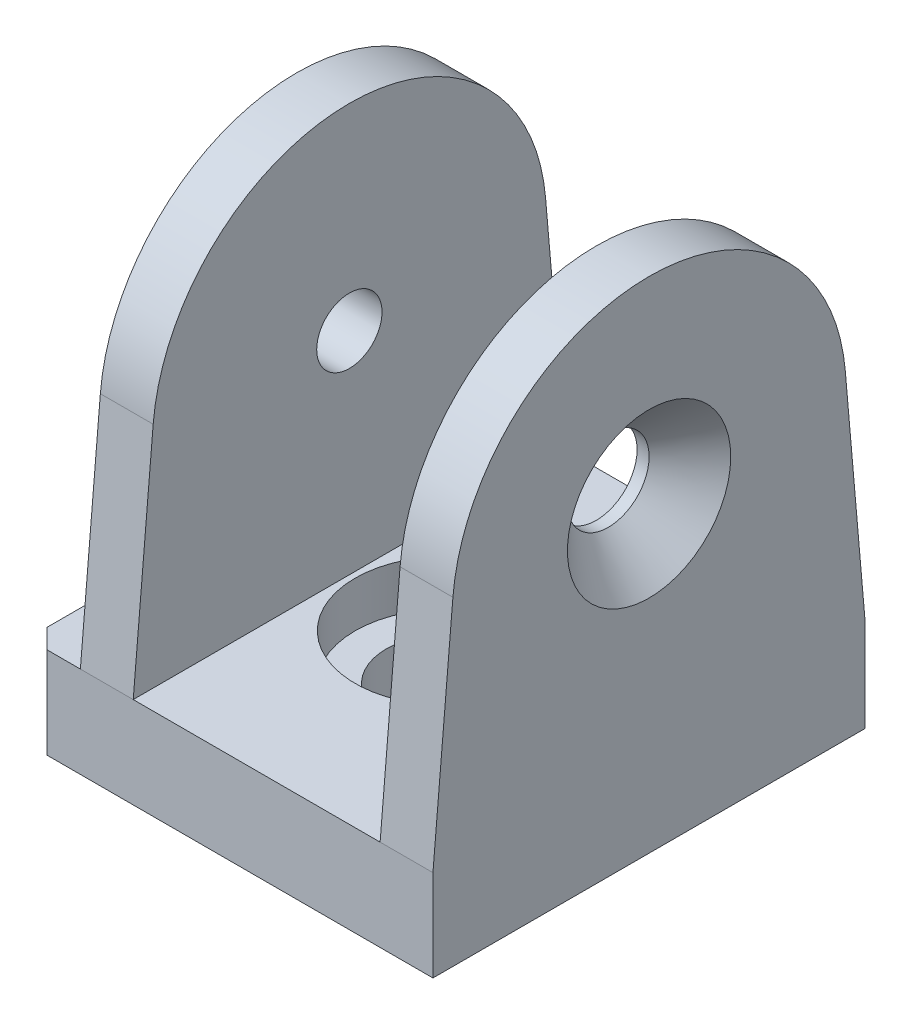
ISO-10303-21;
HEADER;
FILE_DESCRIPTION(('STEP AP214'),'2;1');
FILE_NAME('part.step','',(''),(''),'','','');
FILE_SCHEMA(('AUTOMOTIVE_DESIGN { 1 0 10303 214 1 1 1 1 }'));
ENDSEC;
DATA;
#1=APPLICATION_CONTEXT('core data for automotive mechanical design processes');
#2=APPLICATION_PROTOCOL_DEFINITION('international standard','automotive_design',2000,#1);
#3=PRODUCT_CONTEXT('',#1,'mechanical');
#4=PRODUCT('Part','Part','',(#3));
#5=PRODUCT_RELATED_PRODUCT_CATEGORY('part','',(#4));
#6=PRODUCT_DEFINITION_FORMATION('','',#4);
#7=PRODUCT_DEFINITION_CONTEXT('part definition',#1,'design');
#8=PRODUCT_DEFINITION('design','',#6,#7);
#9=PRODUCT_DEFINITION_SHAPE('','',#8);
#10=(LENGTH_UNIT() NAMED_UNIT(*) SI_UNIT(.MILLI.,.METRE.));
#11=(NAMED_UNIT(*) PLANE_ANGLE_UNIT() SI_UNIT($,.RADIAN.));
#12=(NAMED_UNIT(*) SI_UNIT($,.STERADIAN.) SOLID_ANGLE_UNIT());
#13=UNCERTAINTY_MEASURE_WITH_UNIT(LENGTH_MEASURE(1.E-05),#10,'distance_accuracy_value','');
#14=(GEOMETRIC_REPRESENTATION_CONTEXT(3) GLOBAL_UNCERTAINTY_ASSIGNED_CONTEXT((#13)) GLOBAL_UNIT_ASSIGNED_CONTEXT((#10,
#11,#12)) REPRESENTATION_CONTEXT('',''));
#15=CARTESIAN_POINT('',(0.,0.,0.));
#16=DIRECTION('',(0.,0.,1.));
#17=DIRECTION('',(1.,0.,0.));
#18=AXIS2_PLACEMENT_3D('',#15,#16,#17);
#19=CARTESIAN_POINT('',(-15.6,33.2840876711679,-20.4222190562531));
#20=DIRECTION('',(0.,0.0870286668862406,-0.996205807622102));
#21=DIRECTION('',(0.,0.996205807622102,0.0870286668862406));
#22=AXIS2_PLACEMENT_3D('',#19,#20,#21);
#23=PLANE('',#22);
#24=DIRECTION('',(0.,-0.996205807622102,-0.0870286668862406));
#25=VECTOR('',#24,1.);
#26=CARTESIAN_POINT('',(15.6,33.2840876711679,-20.4222190562531));
#27=LINE('',#26,#25);
#28=CARTESIAN_POINT('',(15.6,33.2840876711679,-20.4222190562531));
#29=VERTEX_POINT('',#28);
#30=CARTESIAN_POINT('',(15.6,9.5,-22.5));
#31=VERTEX_POINT('',#30);
#32=EDGE_CURVE('E145',#29,#31,#27,.T.);
#33=ORIENTED_EDGE('',*,*,#32,.F.);
#34=DIRECTION('',(1.,0.,0.));
#35=VECTOR('',#34,1.);
#36=CARTESIAN_POINT('',(-15.6,33.2840876711679,-20.4222190562531));
#37=LINE('',#36,#35);
#38=CARTESIAN_POINT('',(21.1,33.2840876711679,-20.4222190562531));
#39=VERTEX_POINT('',#38);
#40=EDGE_CURVE('E190',#29,#39,#37,.T.);
#41=ORIENTED_EDGE('',*,*,#40,.T.);
#42=DIRECTION('',(0.,0.996205807622102,0.0870286668862406));
#43=VECTOR('',#42,1.);
#44=CARTESIAN_POINT('',(21.1,33.2840876711679,-20.4222190562531));
#45=LINE('',#44,#43);
#46=CARTESIAN_POINT('',(21.1,9.5,-22.5));
#47=VERTEX_POINT('',#46);
#48=EDGE_CURVE('E258',#47,#39,#45,.T.);
#49=ORIENTED_EDGE('',*,*,#48,.F.);
#50=DIRECTION('',(-1.,0.,0.));
#51=VECTOR('',#50,1.);
#52=CARTESIAN_POINT('',(21.1,9.5,-22.5));
#53=LINE('',#52,#51);
#54=EDGE_CURVE('E211',#47,#31,#53,.T.);
#55=ORIENTED_EDGE('',*,*,#54,.T.);
#56=EDGE_LOOP('',(#33,#41,#49,#55));
#57=FACE_BOUND('',#56,.T.);
#58=ADVANCED_FACE('F39',(#57),#23,.T.);
#59=CARTESIAN_POINT('',(-15.6,31.5,0.));
#60=DIRECTION('',(1.,0.,0.));
#61=DIRECTION('',(0.,0.,-1.));
#62=AXIS2_PLACEMENT_3D('',#59,#60,#61);
#63=CYLINDRICAL_SURFACE('',#62,20.5);
#64=DIRECTION('',(1.,0.,0.));
#65=VECTOR('',#64,1.);
#66=CARTESIAN_POINT('',(-15.6,33.2840876711679,20.4222190562531));
#67=LINE('',#66,#65);
#68=CARTESIAN_POINT('',(-15.6,33.2840876711679,20.4222190562531));
#69=VERTEX_POINT('',#68);
#70=CARTESIAN_POINT('',(-10.1,33.2840876711679,20.4222190562531));
#71=VERTEX_POINT('',#70);
#72=EDGE_CURVE('E178',#69,#71,#67,.T.);
#73=ORIENTED_EDGE('',*,*,#72,.T.);
#74=CARTESIAN_POINT('',(-10.1,31.5,0.));
#75=DIRECTION('',(-1.,0.,0.));
#76=DIRECTION('',(0.,-1.,0.));
#77=AXIS2_PLACEMENT_3D('',#74,#75,#76);
#78=CIRCLE('',#77,20.5);
#79=CARTESIAN_POINT('',(-10.1,33.2840876711679,-20.4222190562531));
#80=VERTEX_POINT('',#79);
#81=EDGE_CURVE('E149',#80,#71,#78,.F.);
#82=ORIENTED_EDGE('',*,*,#81,.F.);
#83=CARTESIAN_POINT('',(-15.6,33.2840876711679,-20.4222190562531));
#84=VERTEX_POINT('',#83);
#85=EDGE_CURVE('E187',#84,#80,#37,.T.);
#86=ORIENTED_EDGE('',*,*,#85,.F.);
#87=CARTESIAN_POINT('',(-15.6,31.5,0.));
#88=DIRECTION('',(1.,0.,0.));
#89=DIRECTION('',(0.,0.,1.));
#90=AXIS2_PLACEMENT_3D('',#87,#88,#89);
#91=CIRCLE('',#90,20.5);
#92=EDGE_CURVE('E313',#84,#69,#91,.T.);
#93=ORIENTED_EDGE('',*,*,#92,.T.);
#94=EDGE_LOOP('',(#73,#82,#86,#93));
#95=FACE_BOUND('',#94,.T.);
#96=ADVANCED_FACE('F273',(#95),#63,.T.);
#97=CARTESIAN_POINT('',(-15.6,9.5,22.5));
#98=DIRECTION('',(0.,0.0870286668862403,0.996205807622102));
#99=DIRECTION('',(0.,-0.996205807622102,0.0870286668862403));
#100=AXIS2_PLACEMENT_3D('',#97,#98,#99);
#101=PLANE('',#100);
#102=DIRECTION('',(0.,0.996205807622102,-0.0870286668862403));
#103=VECTOR('',#102,1.);
#104=CARTESIAN_POINT('',(15.6,9.5,22.5));
#105=LINE('',#104,#103);
#106=CARTESIAN_POINT('',(15.6,9.5,22.5));
#107=VERTEX_POINT('',#106);
#108=CARTESIAN_POINT('',(15.6,33.2840876711679,20.4222190562531));
#109=VERTEX_POINT('',#108);
#110=EDGE_CURVE('E142',#107,#109,#105,.T.);
#111=ORIENTED_EDGE('',*,*,#110,.F.);
#112=DIRECTION('',(1.,0.,0.));
#113=VECTOR('',#112,1.);
#114=CARTESIAN_POINT('',(-15.6,9.5,22.5));
#115=LINE('',#114,#113);
#116=CARTESIAN_POINT('',(21.1,9.5,22.5));
#117=VERTEX_POINT('',#116);
#118=EDGE_CURVE('E167',#107,#117,#115,.T.);
#119=ORIENTED_EDGE('',*,*,#118,.T.);
#120=DIRECTION('',(0.,-0.996205807622102,0.0870286668862403));
#121=VECTOR('',#120,1.);
#122=CARTESIAN_POINT('',(21.1,9.5,22.5));
#123=LINE('',#122,#121);
#124=CARTESIAN_POINT('',(21.1,33.2840876711679,20.4222190562531));
#125=VERTEX_POINT('',#124);
#126=EDGE_CURVE('E184',#125,#117,#123,.T.);
#127=ORIENTED_EDGE('',*,*,#126,.F.);
#128=EDGE_CURVE('E169',#109,#125,#67,.T.);
#129=ORIENTED_EDGE('',*,*,#128,.F.);
#130=EDGE_LOOP('',(#111,#119,#127,#129));
#131=FACE_BOUND('',#130,.T.);
#132=ADVANCED_FACE('F165',(#131),#101,.T.);
#133=CARTESIAN_POINT('',(0.,9.5,0.));
#134=DIRECTION('',(0.,1.,0.));
#135=DIRECTION('',(0.,0.,1.));
#136=AXIS2_PLACEMENT_3D('',#133,#134,#135);
#137=PLANE('',#136);
#138=CARTESIAN_POINT('',(-15.6,9.5,-22.5));
#139=VERTEX_POINT('',#138);
#140=CARTESIAN_POINT('',(-19.1,9.5,-22.5));
#141=VERTEX_POINT('',#140);
#142=EDGE_CURVE('E210',#139,#141,#53,.T.);
#143=ORIENTED_EDGE('',*,*,#142,.T.);
#144=DIRECTION('',(0.707106781186549,0.,-0.707106781186546));
#145=VECTOR('',#144,1.);
#146=CARTESIAN_POINT('',(-20.8,9.5,-20.8));
#147=LINE('',#146,#145);
#148=CARTESIAN_POINT('',(-21.1,9.5,-20.5));
#149=VERTEX_POINT('',#148);
#150=EDGE_CURVE('E48',#141,#149,#147,.F.);
#151=ORIENTED_EDGE('',*,*,#150,.T.);
#152=DIRECTION('',(0.,0.,1.));
#153=VECTOR('',#152,1.);
#154=CARTESIAN_POINT('',(-21.1,9.5,22.5));
#155=LINE('',#154,#153);
#156=CARTESIAN_POINT('',(-21.1,9.5,20.5));
#157=VERTEX_POINT('',#156);
#158=EDGE_CURVE('E205',#149,#157,#155,.T.);
#159=ORIENTED_EDGE('',*,*,#158,.T.);
#160=DIRECTION('',(-0.707106781186546,0.,-0.707106781186549));
#161=VECTOR('',#160,1.);
#162=CARTESIAN_POINT('',(-20.8,9.5,20.8));
#163=LINE('',#162,#161);
#164=CARTESIAN_POINT('',(-19.1,9.5,22.5));
#165=VERTEX_POINT('',#164);
#166=EDGE_CURVE('E55',#157,#165,#163,.F.);
#167=ORIENTED_EDGE('',*,*,#166,.T.);
#168=DIRECTION('',(1.,0.,0.));
#169=VECTOR('',#168,1.);
#170=CARTESIAN_POINT('',(21.1,9.5,22.5));
#171=LINE('',#170,#169);
#172=CARTESIAN_POINT('',(-15.6,9.5,22.5));
#173=VERTEX_POINT('',#172);
#174=EDGE_CURVE('E207',#165,#173,#171,.T.);
#175=ORIENTED_EDGE('',*,*,#174,.T.);
#176=DIRECTION('',(0.,0.,-1.));
#177=VECTOR('',#176,1.);
#178=CARTESIAN_POINT('',(-15.6,9.5,-22.5));
#179=LINE('',#178,#177);
#180=EDGE_CURVE('E318',#173,#139,#179,.T.);
#181=ORIENTED_EDGE('',*,*,#180,.T.);
#182=EDGE_LOOP('',(#143,#151,#159,#167,#175,#181));
#183=FACE_BOUND('',#182,.T.);
#184=ADVANCED_FACE('F238',(#183),#137,.T.);
#185=CARTESIAN_POINT('',(-21.1,9.5,22.5));
#186=DIRECTION('',(1.,0.,0.));
#187=DIRECTION('',(0.,0.,-1.));
#188=AXIS2_PLACEMENT_3D('',#185,#186,#187);
#189=PLANE('',#188);
#190=ORIENTED_EDGE('',*,*,#158,.F.);
#191=DIRECTION('',(0.,-1.,0.));
#192=VECTOR('',#191,1.);
#193=CARTESIAN_POINT('',(-21.1,9.5,-20.5));
#194=LINE('',#193,#192);
#195=CARTESIAN_POINT('',(-21.1,0.,-20.5));
#196=VERTEX_POINT('',#195);
#197=EDGE_CURVE('E228',#149,#196,#194,.T.);
#198=ORIENTED_EDGE('',*,*,#197,.T.);
#199=DIRECTION('',(0.,0.,1.));
#200=VECTOR('',#199,1.);
#201=CARTESIAN_POINT('',(-21.1,0.,22.5));
#202=LINE('',#201,#200);
#203=CARTESIAN_POINT('',(-21.1,0.,20.5));
#204=VERTEX_POINT('',#203);
#205=EDGE_CURVE('E204',#196,#204,#202,.T.);
#206=ORIENTED_EDGE('',*,*,#205,.T.);
#207=DIRECTION('',(0.,1.,0.));
#208=VECTOR('',#207,1.);
#209=CARTESIAN_POINT('',(-21.1,9.5,20.5));
#210=LINE('',#209,#208);
#211=EDGE_CURVE('E170',#204,#157,#210,.T.);
#212=ORIENTED_EDGE('',*,*,#211,.T.);
#213=EDGE_LOOP('',(#190,#198,#206,#212));
#214=FACE_BOUND('',#213,.T.);
#215=ADVANCED_FACE('F243',(#214),#189,.F.);
#216=CARTESIAN_POINT('',(21.1,9.5,22.5));
#217=DIRECTION('',(0.,0.,-1.));
#218=DIRECTION('',(-1.,0.,0.));
#219=AXIS2_PLACEMENT_3D('',#216,#217,#218);
#220=PLANE('',#219);
#221=ORIENTED_EDGE('',*,*,#174,.F.);
#222=DIRECTION('',(0.,-1.,0.));
#223=VECTOR('',#222,1.);
#224=CARTESIAN_POINT('',(-19.1,9.5,22.5));
#225=LINE('',#224,#223);
#226=CARTESIAN_POINT('',(-19.1,0.,22.5));
#227=VERTEX_POINT('',#226);
#228=EDGE_CURVE('E11',#165,#227,#225,.T.);
#229=ORIENTED_EDGE('',*,*,#228,.T.);
#230=DIRECTION('',(1.,0.,0.));
#231=VECTOR('',#230,1.);
#232=CARTESIAN_POINT('',(21.1,0.,22.5));
#233=LINE('',#232,#231);
#234=CARTESIAN_POINT('',(21.1,0.,22.5));
#235=VERTEX_POINT('',#234);
#236=EDGE_CURVE('E218',#227,#235,#233,.T.);
#237=ORIENTED_EDGE('',*,*,#236,.T.);
#238=DIRECTION('',(0.,-1.,0.));
#239=VECTOR('',#238,1.);
#240=CARTESIAN_POINT('',(21.1,9.5,22.5));
#241=LINE('',#240,#239);
#242=EDGE_CURVE('E176',#117,#235,#241,.T.);
#243=ORIENTED_EDGE('',*,*,#242,.F.);
#244=ORIENTED_EDGE('',*,*,#118,.F.);
#245=DIRECTION('',(1.,0.,0.));
#246=VECTOR('',#245,1.);
#247=CARTESIAN_POINT('',(15.6,9.5,22.5));
#248=LINE('',#247,#246);
#249=CARTESIAN_POINT('',(-10.1,9.5,22.5));
#250=VERTEX_POINT('',#249);
#251=EDGE_CURVE('E153',#250,#107,#248,.T.);
#252=ORIENTED_EDGE('',*,*,#251,.F.);
#253=EDGE_CURVE('E177',#173,#250,#115,.T.);
#254=ORIENTED_EDGE('',*,*,#253,.F.);
#255=EDGE_LOOP('',(#221,#229,#237,#243,#244,#252,#254));
#256=FACE_BOUND('',#255,.T.);
#257=ADVANCED_FACE('F174',(#256),#220,.F.);
#258=CARTESIAN_POINT('',(21.1,9.5,22.5));
#259=DIRECTION('',(-1.,0.,0.));
#260=DIRECTION('',(0.,0.,1.));
#261=AXIS2_PLACEMENT_3D('',#258,#259,#260);
#262=PLANE('',#261);
#263=CARTESIAN_POINT('',(21.1,31.5,0.));
#264=DIRECTION('',(1.,0.,0.));
#265=DIRECTION('',(0.,0.,-1.));
#266=AXIS2_PLACEMENT_3D('',#263,#264,#265);
#267=CIRCLE('',#266,8.5);
#268=CARTESIAN_POINT('',(21.1,31.5,-8.5));
#269=VERTEX_POINT('',#268);
#270=EDGE_CURVE('E328',#269,#269,#267,.T.);
#271=ORIENTED_EDGE('',*,*,#270,.F.);
#272=EDGE_LOOP('',(#271));
#273=FACE_BOUND('',#272,.T.);
#274=DIRECTION('',(0.,0.,-1.));
#275=VECTOR('',#274,1.);
#276=CARTESIAN_POINT('',(21.1,0.,22.5));
#277=LINE('',#276,#275);
#278=CARTESIAN_POINT('',(21.1,0.,-22.5));
#279=VERTEX_POINT('',#278);
#280=EDGE_CURVE('E220',#235,#279,#277,.T.);
#281=ORIENTED_EDGE('',*,*,#280,.T.);
#282=DIRECTION('',(0.,-1.,0.));
#283=VECTOR('',#282,1.);
#284=CARTESIAN_POINT('',(21.1,9.5,-22.5));
#285=LINE('',#284,#283);
#286=EDGE_CURVE('E214',#47,#279,#285,.T.);
#287=ORIENTED_EDGE('',*,*,#286,.F.);
#288=ORIENTED_EDGE('',*,*,#48,.T.);
#289=CARTESIAN_POINT('',(21.1,31.5,0.));
#290=DIRECTION('',(1.,0.,0.));
#291=DIRECTION('',(0.,0.,1.));
#292=AXIS2_PLACEMENT_3D('',#289,#290,#291);
#293=CIRCLE('',#292,20.5);
#294=EDGE_CURVE('E306',#39,#125,#293,.T.);
#295=ORIENTED_EDGE('',*,*,#294,.T.);
#296=ORIENTED_EDGE('',*,*,#126,.T.);
#297=ORIENTED_EDGE('',*,*,#242,.T.);
#298=EDGE_LOOP('',(#281,#287,#288,#295,#296,#297));
#299=FACE_BOUND('',#298,.T.);
#300=ADVANCED_FACE('F256',(#273,#299),#262,.F.);
#301=CARTESIAN_POINT('',(21.1,9.5,-22.5));
#302=DIRECTION('',(0.,0.,1.));
#303=DIRECTION('',(1.,0.,0.));
#304=AXIS2_PLACEMENT_3D('',#301,#302,#303);
#305=PLANE('',#304);
#306=DIRECTION('',(-1.,0.,0.));
#307=VECTOR('',#306,1.);
#308=CARTESIAN_POINT('',(21.1,0.,-22.5));
#309=LINE('',#308,#307);
#310=CARTESIAN_POINT('',(-19.1,0.,-22.5));
#311=VERTEX_POINT('',#310);
#312=EDGE_CURVE('E208',#279,#311,#309,.T.);
#313=ORIENTED_EDGE('',*,*,#312,.T.);
#314=DIRECTION('',(0.,1.,0.));
#315=VECTOR('',#314,1.);
#316=CARTESIAN_POINT('',(-19.1,9.5,-22.5));
#317=LINE('',#316,#315);
#318=EDGE_CURVE('E63',#311,#141,#317,.T.);
#319=ORIENTED_EDGE('',*,*,#318,.T.);
#320=ORIENTED_EDGE('',*,*,#142,.F.);
#321=CARTESIAN_POINT('',(-10.1,9.5,-22.5));
#322=VERTEX_POINT('',#321);
#323=EDGE_CURVE('E215',#322,#139,#53,.T.);
#324=ORIENTED_EDGE('',*,*,#323,.F.);
#325=DIRECTION('',(1.,0.,0.));
#326=VECTOR('',#325,1.);
#327=CARTESIAN_POINT('',(15.6,9.5,-22.5));
#328=LINE('',#327,#326);
#329=EDGE_CURVE('E161',#322,#31,#328,.T.);
#330=ORIENTED_EDGE('',*,*,#329,.T.);
#331=ORIENTED_EDGE('',*,*,#54,.F.);
#332=ORIENTED_EDGE('',*,*,#286,.T.);
#333=EDGE_LOOP('',(#313,#319,#320,#324,#330,#331,#332));
#334=FACE_BOUND('',#333,.T.);
#335=ADVANCED_FACE('F251',(#334),#305,.F.);
#336=CARTESIAN_POINT('',(0.,0.,0.));
#337=DIRECTION('',(0.,1.,0.));
#338=DIRECTION('',(0.,0.,1.));
#339=AXIS2_PLACEMENT_3D('',#336,#337,#338);
#340=PLANE('',#339);
#341=CARTESIAN_POINT('',(0.,0.,0.));
#342=DIRECTION('',(0.,1.,0.));
#343=DIRECTION('',(-1.,0.,0.));
#344=AXIS2_PLACEMENT_3D('',#341,#342,#343);
#345=CIRCLE('',#344,6.25);
#346=CARTESIAN_POINT('',(-6.25,0.,0.));
#347=VERTEX_POINT('',#346);
#348=EDGE_CURVE('E201',#347,#347,#345,.T.);
#349=ORIENTED_EDGE('',*,*,#348,.T.);
#350=EDGE_LOOP('',(#349));
#351=FACE_BOUND('',#350,.T.);
#352=ORIENTED_EDGE('',*,*,#205,.F.);
#353=DIRECTION('',(-0.707106781186549,0.,0.707106781186546));
#354=VECTOR('',#353,1.);
#355=CARTESIAN_POINT('',(-21.1,0.,-20.5));
#356=LINE('',#355,#354);
#357=EDGE_CURVE('E233',#196,#311,#356,.F.);
#358=ORIENTED_EDGE('',*,*,#357,.T.);
#359=ORIENTED_EDGE('',*,*,#312,.F.);
#360=ORIENTED_EDGE('',*,*,#280,.F.);
#361=ORIENTED_EDGE('',*,*,#236,.F.);
#362=DIRECTION('',(0.707106781186546,0.,0.707106781186549));
#363=VECTOR('',#362,1.);
#364=CARTESIAN_POINT('',(-19.1,0.,22.5));
#365=LINE('',#364,#363);
#366=EDGE_CURVE('E231',#227,#204,#365,.F.);
#367=ORIENTED_EDGE('',*,*,#366,.T.);
#368=EDGE_LOOP('',(#352,#358,#359,#360,#361,#367));
#369=FACE_BOUND('',#368,.T.);
#370=ADVANCED_FACE('F249',(#351,#369),#340,.F.);
#371=CARTESIAN_POINT('',(0.,9.5,0.));
#372=DIRECTION('',(0.,1.,0.));
#373=DIRECTION('',(-1.,0.,0.));
#374=AXIS2_PLACEMENT_3D('',#371,#372,#373);
#375=CYLINDRICAL_SURFACE('',#374,6.25);
#376=ORIENTED_EDGE('',*,*,#348,.F.);
#377=EDGE_LOOP('',(#376));
#378=FACE_BOUND('',#377,.T.);
#379=CARTESIAN_POINT('',(0.,4.75,0.));
#380=DIRECTION('',(0.,1.,0.));
#381=DIRECTION('',(-1.,0.,0.));
#382=AXIS2_PLACEMENT_3D('',#379,#380,#381);
#383=CIRCLE('',#382,6.25);
#384=CARTESIAN_POINT('',(-6.25,4.75,0.));
#385=VERTEX_POINT('',#384);
#386=EDGE_CURVE('E198',#385,#385,#383,.T.);
#387=ORIENTED_EDGE('',*,*,#386,.T.);
#388=EDGE_LOOP('',(#387));
#389=FACE_BOUND('',#388,.T.);
#390=ADVANCED_FACE('F370',(#378,#389),#375,.F.);
#391=CARTESIAN_POINT('',(-6.25,4.75,0.));
#392=DIRECTION('',(0.,-1.,0.));
#393=DIRECTION('',(1.,0.,0.));
#394=AXIS2_PLACEMENT_3D('',#391,#392,#393);
#395=PLANE('',#394);
#396=ORIENTED_EDGE('',*,*,#386,.F.);
#397=EDGE_LOOP('',(#396));
#398=FACE_BOUND('',#397,.T.);
#399=CARTESIAN_POINT('',(0.,4.75000000000001,0.));
#400=DIRECTION('',(0.,1.,0.));
#401=DIRECTION('',(-1.,0.,0.));
#402=AXIS2_PLACEMENT_3D('',#399,#400,#401);
#403=CIRCLE('',#402,9.5);
#404=CARTESIAN_POINT('',(-9.5,4.75,0.));
#405=VERTEX_POINT('',#404);
#406=EDGE_CURVE('E180',#405,#405,#403,.T.);
#407=ORIENTED_EDGE('',*,*,#406,.T.);
#408=EDGE_LOOP('',(#407));
#409=FACE_BOUND('',#408,.T.);
#410=ADVANCED_FACE('F410',(#398,#409),#395,.F.);
#411=CARTESIAN_POINT('',(0.,9.5,0.));
#412=DIRECTION('',(0.,1.,0.));
#413=DIRECTION('',(-1.,0.,0.));
#414=AXIS2_PLACEMENT_3D('',#411,#412,#413);
#415=CYLINDRICAL_SURFACE('',#414,9.5);
#416=ORIENTED_EDGE('',*,*,#406,.F.);
#417=EDGE_LOOP('',(#416));
#418=FACE_BOUND('',#417,.T.);
#419=CARTESIAN_POINT('',(0.,9.50000000000001,0.));
#420=DIRECTION('',(0.,1.,0.));
#421=DIRECTION('',(-1.,0.,0.));
#422=AXIS2_PLACEMENT_3D('',#419,#420,#421);
#423=CIRCLE('',#422,9.5);
#424=CARTESIAN_POINT('',(-9.5,9.5,0.));
#425=VERTEX_POINT('',#424);
#426=EDGE_CURVE('E191',#425,#425,#423,.T.);
#427=ORIENTED_EDGE('',*,*,#426,.T.);
#428=EDGE_LOOP('',(#427));
#429=FACE_BOUND('',#428,.T.);
#430=ADVANCED_FACE('F293',(#418,#429),#415,.F.);
#431=CARTESIAN_POINT('',(-15.6,31.5,0.));
#432=DIRECTION('',(-1.,0.,0.));
#433=DIRECTION('',(0.,0.,1.));
#434=AXIS2_PLACEMENT_3D('',#431,#432,#433);
#435=PLANE('',#434);
#436=CARTESIAN_POINT('',(-15.6,31.5,0.));
#437=DIRECTION('',(-1.,0.,0.));
#438=DIRECTION('',(0.,0.,1.));
#439=AXIS2_PLACEMENT_3D('',#436,#437,#438);
#440=CIRCLE('',#439,3.4);
#441=CARTESIAN_POINT('',(-15.6,31.5,3.4));
#442=VERTEX_POINT('',#441);
#443=EDGE_CURVE('E334',#442,#442,#440,.T.);
#444=ORIENTED_EDGE('',*,*,#443,.F.);
#445=EDGE_LOOP('',(#444));
#446=FACE_BOUND('',#445,.T.);
#447=ORIENTED_EDGE('',*,*,#180,.F.);
#448=DIRECTION('',(0.,-0.996205807622102,0.0870286668862403));
#449=VECTOR('',#448,1.);
#450=CARTESIAN_POINT('',(-15.6,9.5,22.5));
#451=LINE('',#450,#449);
#452=EDGE_CURVE('E310',#69,#173,#451,.T.);
#453=ORIENTED_EDGE('',*,*,#452,.F.);
#454=ORIENTED_EDGE('',*,*,#92,.F.);
#455=DIRECTION('',(0.,0.996205807622102,0.0870286668862406));
#456=VECTOR('',#455,1.);
#457=CARTESIAN_POINT('',(-15.6,33.2840876711679,-20.4222190562531));
#458=LINE('',#457,#456);
#459=EDGE_CURVE('E316',#139,#84,#458,.T.);
#460=ORIENTED_EDGE('',*,*,#459,.F.);
#461=EDGE_LOOP('',(#447,#453,#454,#460));
#462=FACE_BOUND('',#461,.T.);
#463=ADVANCED_FACE('F285',(#446,#462),#435,.T.);
#464=DIRECTION('',(0.,0.996205807622102,0.0870286668862406));
#465=VECTOR('',#464,1.);
#466=CARTESIAN_POINT('',(-10.1,33.2840876711679,-20.4222190562531));
#467=LINE('',#466,#465);
#468=EDGE_CURVE('E195',#322,#80,#467,.T.);
#469=ORIENTED_EDGE('',*,*,#468,.F.);
#470=ORIENTED_EDGE('',*,*,#323,.T.);
#471=ORIENTED_EDGE('',*,*,#459,.T.);
#472=ORIENTED_EDGE('',*,*,#85,.T.);
#473=EDGE_LOOP('',(#469,#470,#471,#472));
#474=FACE_BOUND('',#473,.T.);
#475=ADVANCED_FACE('F276',(#474),#23,.T.);
#476=CARTESIAN_POINT('',(15.6,31.5,0.));
#477=DIRECTION('',(1.,0.,0.));
#478=DIRECTION('',(0.,0.,-1.));
#479=AXIS2_PLACEMENT_3D('',#476,#477,#478);
#480=CIRCLE('',#479,20.5);
#481=EDGE_CURVE('E194',#109,#29,#480,.F.);
#482=ORIENTED_EDGE('',*,*,#481,.F.);
#483=ORIENTED_EDGE('',*,*,#128,.T.);
#484=ORIENTED_EDGE('',*,*,#294,.F.);
#485=ORIENTED_EDGE('',*,*,#40,.F.);
#486=EDGE_LOOP('',(#482,#483,#484,#485));
#487=FACE_BOUND('',#486,.T.);
#488=ADVANCED_FACE('F282',(#487),#63,.T.);
#489=DIRECTION('',(0.,-0.996205807622102,0.0870286668862403));
#490=VECTOR('',#489,1.);
#491=CARTESIAN_POINT('',(-10.1,9.5,22.5));
#492=LINE('',#491,#490);
#493=EDGE_CURVE('E171',#71,#250,#492,.T.);
#494=ORIENTED_EDGE('',*,*,#493,.F.);
#495=ORIENTED_EDGE('',*,*,#72,.F.);
#496=ORIENTED_EDGE('',*,*,#452,.T.);
#497=ORIENTED_EDGE('',*,*,#253,.T.);
#498=EDGE_LOOP('',(#494,#495,#496,#497));
#499=FACE_BOUND('',#498,.T.);
#500=ADVANCED_FACE('F291',(#499),#101,.T.);
#501=CARTESIAN_POINT('',(15.6,9.5,-22.5));
#502=DIRECTION('',(0.,-1.,0.));
#503=DIRECTION('',(1.,0.,0.));
#504=AXIS2_PLACEMENT_3D('',#501,#502,#503);
#505=PLANE('',#504);
#506=DIRECTION('',(0.,0.,1.));
#507=VECTOR('',#506,1.);
#508=CARTESIAN_POINT('',(15.6,9.5,-22.5));
#509=LINE('',#508,#507);
#510=EDGE_CURVE('E138',#31,#107,#509,.T.);
#511=ORIENTED_EDGE('',*,*,#510,.F.);
#512=ORIENTED_EDGE('',*,*,#329,.F.);
#513=DIRECTION('',(0.,0.,1.));
#514=VECTOR('',#513,1.);
#515=CARTESIAN_POINT('',(-10.1,9.5,-22.5));
#516=LINE('',#515,#514);
#517=EDGE_CURVE('E150',#322,#250,#516,.T.);
#518=ORIENTED_EDGE('',*,*,#517,.T.);
#519=ORIENTED_EDGE('',*,*,#251,.T.);
#520=EDGE_LOOP('',(#511,#512,#518,#519));
#521=FACE_BOUND('',#520,.T.);
#522=ORIENTED_EDGE('',*,*,#426,.F.);
#523=EDGE_LOOP('',(#522));
#524=FACE_BOUND('',#523,.T.);
#525=ADVANCED_FACE('F154',(#521,#524),#505,.F.);
#526=CARTESIAN_POINT('',(15.6,9.5,-22.5));
#527=DIRECTION('',(1.,0.,0.));
#528=DIRECTION('',(0.,0.,-1.));
#529=AXIS2_PLACEMENT_3D('',#526,#527,#528);
#530=PLANE('',#529);
#531=CARTESIAN_POINT('',(15.6,31.5,0.));
#532=DIRECTION('',(1.,0.,0.));
#533=DIRECTION('',(0.,0.,-1.));
#534=AXIS2_PLACEMENT_3D('',#531,#532,#533);
#535=CIRCLE('',#534,4.25);
#536=CARTESIAN_POINT('',(15.6,31.5,-4.25));
#537=VERTEX_POINT('',#536);
#538=EDGE_CURVE('E162',#537,#537,#535,.T.);
#539=ORIENTED_EDGE('',*,*,#538,.T.);
#540=EDGE_LOOP('',(#539));
#541=FACE_BOUND('',#540,.T.);
#542=ORIENTED_EDGE('',*,*,#32,.T.);
#543=ORIENTED_EDGE('',*,*,#510,.T.);
#544=ORIENTED_EDGE('',*,*,#110,.T.);
#545=ORIENTED_EDGE('',*,*,#481,.T.);
#546=EDGE_LOOP('',(#542,#543,#544,#545));
#547=FACE_BOUND('',#546,.T.);
#548=ADVANCED_FACE('F140',(#541,#547),#530,.F.);
#549=CARTESIAN_POINT('',(-10.1,9.5,-22.5));
#550=DIRECTION('',(-1.,0.,0.));
#551=DIRECTION('',(0.,-1.,0.));
#552=AXIS2_PLACEMENT_3D('',#549,#550,#551);
#553=PLANE('',#552);
#554=CARTESIAN_POINT('',(-10.1,31.5,0.));
#555=DIRECTION('',(-1.,0.,0.));
#556=DIRECTION('',(0.,-1.,0.));
#557=AXIS2_PLACEMENT_3D('',#554,#555,#556);
#558=CIRCLE('',#557,3.4);
#559=CARTESIAN_POINT('',(-10.1,28.1,0.));
#560=VERTEX_POINT('',#559);
#561=EDGE_CURVE('E331',#560,#560,#558,.T.);
#562=ORIENTED_EDGE('',*,*,#561,.T.);
#563=EDGE_LOOP('',(#562));
#564=FACE_BOUND('',#563,.T.);
#565=ORIENTED_EDGE('',*,*,#468,.T.);
#566=ORIENTED_EDGE('',*,*,#81,.T.);
#567=ORIENTED_EDGE('',*,*,#493,.T.);
#568=ORIENTED_EDGE('',*,*,#517,.F.);
#569=EDGE_LOOP('',(#565,#566,#567,#568));
#570=FACE_BOUND('',#569,.T.);
#571=ADVANCED_FACE('F271',(#564,#570),#553,.F.);
#572=CARTESIAN_POINT('',(-21.1,9.5,-20.5));
#573=DIRECTION('',(0.707106781186546,0.,0.707106781186549));
#574=DIRECTION('',(0.,-1.,0.));
#575=AXIS2_PLACEMENT_3D('',#572,#573,#574);
#576=PLANE('',#575);
#577=ORIENTED_EDGE('',*,*,#150,.F.);
#578=ORIENTED_EDGE('',*,*,#318,.F.);
#579=ORIENTED_EDGE('',*,*,#357,.F.);
#580=ORIENTED_EDGE('',*,*,#197,.F.);
#581=EDGE_LOOP('',(#577,#578,#579,#580));
#582=FACE_BOUND('',#581,.T.);
#583=ADVANCED_FACE('F246',(#582),#576,.F.);
#584=CARTESIAN_POINT('',(-19.1,9.5,22.5));
#585=DIRECTION('',(0.707106781186549,0.,-0.707106781186546));
#586=DIRECTION('',(0.,-1.,0.));
#587=AXIS2_PLACEMENT_3D('',#584,#585,#586);
#588=PLANE('',#587);
#589=ORIENTED_EDGE('',*,*,#166,.F.);
#590=ORIENTED_EDGE('',*,*,#211,.F.);
#591=ORIENTED_EDGE('',*,*,#366,.F.);
#592=ORIENTED_EDGE('',*,*,#228,.F.);
#593=EDGE_LOOP('',(#589,#590,#591,#592));
#594=FACE_BOUND('',#593,.T.);
#595=ADVANCED_FACE('F42',(#594),#588,.F.);
#596=CARTESIAN_POINT('',(21.1,31.5,0.));
#597=DIRECTION('',(1.,0.,0.));
#598=DIRECTION('',(0.,0.,-1.));
#599=AXIS2_PLACEMENT_3D('',#596,#597,#598);
#600=CYLINDRICAL_SURFACE('',#599,4.25);
#601=ORIENTED_EDGE('',*,*,#538,.F.);
#602=EDGE_LOOP('',(#601));
#603=FACE_BOUND('',#602,.T.);
#604=CARTESIAN_POINT('',(16.85,31.5,0.));
#605=DIRECTION('',(1.,0.,0.));
#606=DIRECTION('',(0.,0.,-1.));
#607=AXIS2_PLACEMENT_3D('',#604,#605,#606);
#608=CIRCLE('',#607,4.25);
#609=CARTESIAN_POINT('',(16.85,31.5,-4.25));
#610=VERTEX_POINT('',#609);
#611=EDGE_CURVE('E325',#610,#610,#608,.T.);
#612=ORIENTED_EDGE('',*,*,#611,.T.);
#613=EDGE_LOOP('',(#612));
#614=FACE_BOUND('',#613,.T.);
#615=ADVANCED_FACE('F263',(#603,#614),#600,.F.);
#616=CARTESIAN_POINT('',(21.1,31.5,0.));
#617=DIRECTION('',(1.,0.,0.));
#618=DIRECTION('',(0.,0.,-1.));
#619=AXIS2_PLACEMENT_3D('',#616,#617,#618);
#620=CONICAL_SURFACE('',#619,8.5,0.785398163397449);
#621=ORIENTED_EDGE('',*,*,#611,.F.);
#622=EDGE_LOOP('',(#621));
#623=FACE_BOUND('',#622,.T.);
#624=ORIENTED_EDGE('',*,*,#270,.T.);
#625=EDGE_LOOP('',(#624));
#626=FACE_BOUND('',#625,.T.);
#627=ADVANCED_FACE('F268',(#623,#626),#620,.F.);
#628=CARTESIAN_POINT('',(-15.6,31.5,0.));
#629=DIRECTION('',(-1.,0.,0.));
#630=DIRECTION('',(0.,0.,1.));
#631=AXIS2_PLACEMENT_3D('',#628,#629,#630);
#632=CYLINDRICAL_SURFACE('',#631,3.4);
#633=ORIENTED_EDGE('',*,*,#561,.F.);
#634=EDGE_LOOP('',(#633));
#635=FACE_BOUND('',#634,.T.);
#636=ORIENTED_EDGE('',*,*,#443,.T.);
#637=EDGE_LOOP('',(#636));
#638=FACE_BOUND('',#637,.T.);
#639=ADVANCED_FACE('F338',(#635,#638),#632,.F.);
#640=CLOSED_SHELL('',(#58,#96,#132,#184,#215,#257,#300,#335,#370,#390,#410,#430,#463,#475,#488,
#500,#525,#548,#571,#583,#595,#615,#627,#639));
#641=MANIFOLD_SOLID_BREP('B2',#640);
#642=ADVANCED_BREP_SHAPE_REPRESENTATION('',(#18,#641),#14);
#643=SHAPE_DEFINITION_REPRESENTATION(#9,#642);
ENDSEC;
END-ISO-10303-21;
